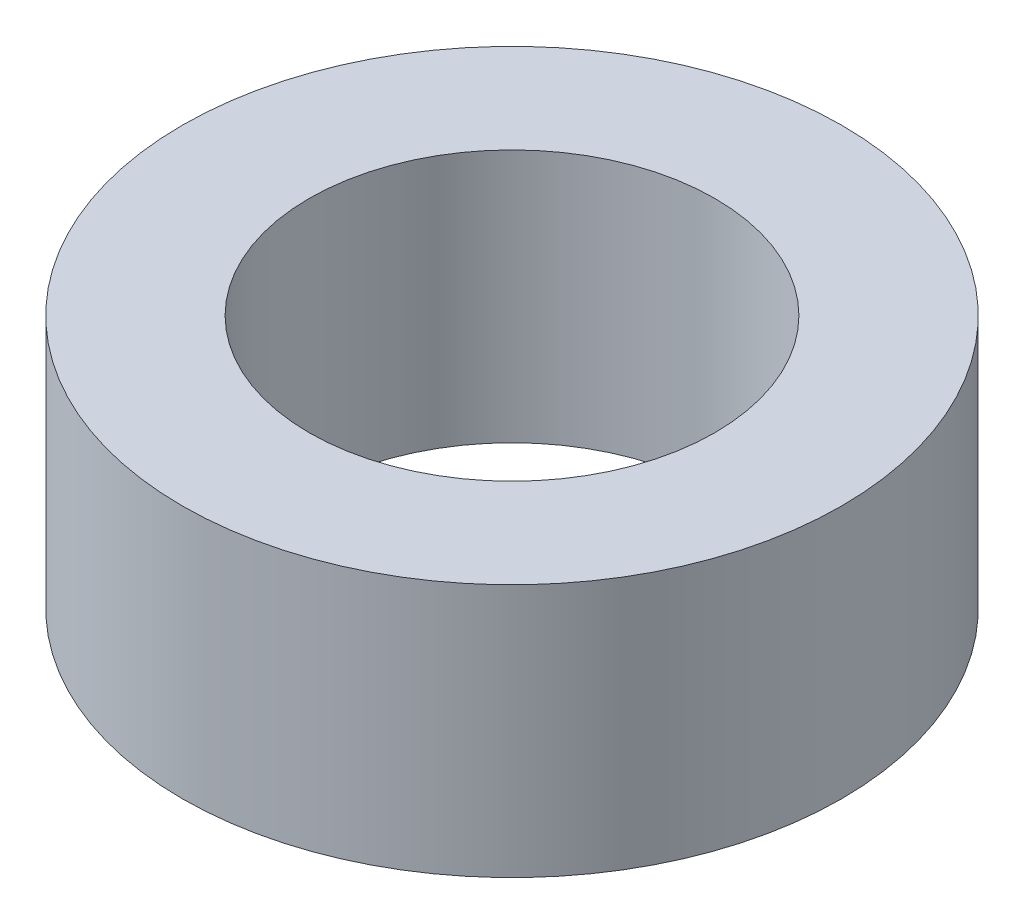
ISO-10303-21;
HEADER;
FILE_DESCRIPTION(('STEP AP214'),'2;1');
FILE_NAME('part.step','',(''),(''),'','','');
FILE_SCHEMA(('AUTOMOTIVE_DESIGN { 1 0 10303 214 1 1 1 1 }'));
ENDSEC;
DATA;
#1=APPLICATION_CONTEXT('core data for automotive mechanical design processes');
#2=APPLICATION_PROTOCOL_DEFINITION('international standard','automotive_design',2000,#1);
#3=PRODUCT_CONTEXT('',#1,'mechanical');
#4=PRODUCT('Part','Part','',(#3));
#5=PRODUCT_RELATED_PRODUCT_CATEGORY('part','',(#4));
#6=PRODUCT_DEFINITION_FORMATION('','',#4);
#7=PRODUCT_DEFINITION_CONTEXT('part definition',#1,'design');
#8=PRODUCT_DEFINITION('design','',#6,#7);
#9=PRODUCT_DEFINITION_SHAPE('','',#8);
#10=(LENGTH_UNIT() NAMED_UNIT(*) SI_UNIT(.MILLI.,.METRE.));
#11=(NAMED_UNIT(*) PLANE_ANGLE_UNIT() SI_UNIT($,.RADIAN.));
#12=(NAMED_UNIT(*) SI_UNIT($,.STERADIAN.) SOLID_ANGLE_UNIT());
#13=UNCERTAINTY_MEASURE_WITH_UNIT(LENGTH_MEASURE(1.E-05),#10,'distance_accuracy_value','');
#14=(GEOMETRIC_REPRESENTATION_CONTEXT(3) GLOBAL_UNCERTAINTY_ASSIGNED_CONTEXT((#13)) GLOBAL_UNIT_ASSIGNED_CONTEXT((#10,
#11,#12)) REPRESENTATION_CONTEXT('',''));
#15=CARTESIAN_POINT('',(0.,0.,0.));
#16=DIRECTION('',(0.,0.,1.));
#17=DIRECTION('',(1.,0.,0.));
#18=AXIS2_PLACEMENT_3D('',#15,#16,#17);
#19=CARTESIAN_POINT('',(0.,4.,0.));
#20=DIRECTION('',(0.,1.,0.));
#21=DIRECTION('',(0.,0.,1.));
#22=AXIS2_PLACEMENT_3D('',#19,#20,#21);
#23=PLANE('',#22);
#24=CARTESIAN_POINT('',(0.,4.,0.));
#25=DIRECTION('',(0.,1.,0.));
#26=DIRECTION('',(0.,0.,1.));
#27=AXIS2_PLACEMENT_3D('',#24,#25,#26);
#28=CIRCLE('',#27,5.2);
#29=CARTESIAN_POINT('',(0.,4.,5.2));
#30=VERTEX_POINT('',#29);
#31=EDGE_CURVE('E10',#30,#30,#28,.T.);
#32=ORIENTED_EDGE('',*,*,#31,.T.);
#33=EDGE_LOOP('',(#32));
#34=FACE_BOUND('',#33,.T.);
#35=CARTESIAN_POINT('',(0.,4.,0.));
#36=DIRECTION('',(0.,1.,0.));
#37=DIRECTION('',(0.,0.,1.));
#38=AXIS2_PLACEMENT_3D('',#35,#36,#37);
#39=CIRCLE('',#38,3.2);
#40=CARTESIAN_POINT('',(0.,4.,3.2));
#41=VERTEX_POINT('',#40);
#42=EDGE_CURVE('E56',#41,#41,#39,.T.);
#43=ORIENTED_EDGE('',*,*,#42,.F.);
#44=EDGE_LOOP('',(#43));
#45=FACE_BOUND('',#44,.T.);
#46=ADVANCED_FACE('F43',(#34,#45),#23,.T.);
#47=CARTESIAN_POINT('',(0.,0.,0.));
#48=DIRECTION('',(0.,1.,0.));
#49=DIRECTION('',(0.,0.,1.));
#50=AXIS2_PLACEMENT_3D('',#47,#48,#49);
#51=PLANE('',#50);
#52=CARTESIAN_POINT('',(0.,0.,0.));
#53=DIRECTION('',(0.,1.,0.));
#54=DIRECTION('',(0.,0.,1.));
#55=AXIS2_PLACEMENT_3D('',#52,#53,#54);
#56=CIRCLE('',#55,5.2);
#57=CARTESIAN_POINT('',(0.,0.,5.2));
#58=VERTEX_POINT('',#57);
#59=EDGE_CURVE('E47',#58,#58,#56,.T.);
#60=ORIENTED_EDGE('',*,*,#59,.F.);
#61=EDGE_LOOP('',(#60));
#62=FACE_BOUND('',#61,.T.);
#63=CARTESIAN_POINT('',(0.,0.,0.));
#64=DIRECTION('',(0.,1.,0.));
#65=DIRECTION('',(0.,0.,1.));
#66=AXIS2_PLACEMENT_3D('',#63,#64,#65);
#67=CIRCLE('',#66,3.2);
#68=CARTESIAN_POINT('',(0.,0.,3.2));
#69=VERTEX_POINT('',#68);
#70=EDGE_CURVE('E58',#69,#69,#67,.T.);
#71=ORIENTED_EDGE('',*,*,#70,.T.);
#72=EDGE_LOOP('',(#71));
#73=FACE_BOUND('',#72,.T.);
#74=ADVANCED_FACE('F70',(#62,#73),#51,.F.);
#75=CARTESIAN_POINT('',(0.,4.,0.));
#76=DIRECTION('',(0.,-1.,0.));
#77=DIRECTION('',(0.,0.,-1.));
#78=AXIS2_PLACEMENT_3D('',#75,#76,#77);
#79=CYLINDRICAL_SURFACE('',#78,5.2);
#80=ORIENTED_EDGE('',*,*,#31,.F.);
#81=EDGE_LOOP('',(#80));
#82=FACE_BOUND('',#81,.T.);
#83=ORIENTED_EDGE('',*,*,#59,.T.);
#84=EDGE_LOOP('',(#83));
#85=FACE_BOUND('',#84,.T.);
#86=ADVANCED_FACE('F45',(#82,#85),#79,.T.);
#87=CARTESIAN_POINT('',(0.,4.,0.));
#88=DIRECTION('',(0.,-1.,0.));
#89=DIRECTION('',(0.,0.,-1.));
#90=AXIS2_PLACEMENT_3D('',#87,#88,#89);
#91=CYLINDRICAL_SURFACE('',#90,3.2);
#92=ORIENTED_EDGE('',*,*,#42,.T.);
#93=EDGE_LOOP('',(#92));
#94=FACE_BOUND('',#93,.T.);
#95=ORIENTED_EDGE('',*,*,#70,.F.);
#96=EDGE_LOOP('',(#95));
#97=FACE_BOUND('',#96,.T.);
#98=ADVANCED_FACE('F66',(#94,#97),#91,.F.);
#99=CLOSED_SHELL('',(#46,#74,#86,#98));
#100=MANIFOLD_SOLID_BREP('B2',#99);
#101=ADVANCED_BREP_SHAPE_REPRESENTATION('',(#18,#100),#14);
#102=SHAPE_DEFINITION_REPRESENTATION(#9,#101);
ENDSEC;
END-ISO-10303-21;
